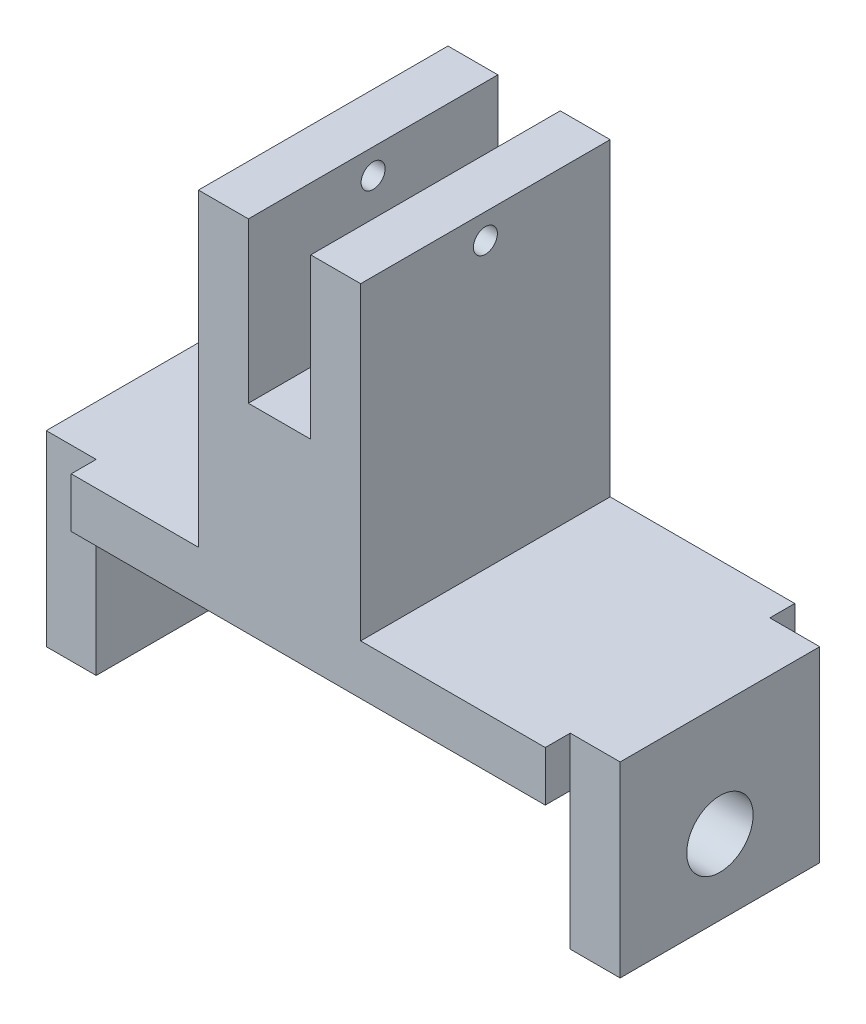
ISO-10303-21;
HEADER;
FILE_DESCRIPTION(('STEP AP214'),'2;1');
FILE_NAME('part.step','',(''),(''),'','','');
FILE_SCHEMA(('AUTOMOTIVE_DESIGN { 1 0 10303 214 1 1 1 1 }'));
ENDSEC;
DATA;
#1=APPLICATION_CONTEXT('core data for automotive mechanical design processes');
#2=APPLICATION_PROTOCOL_DEFINITION('international standard','automotive_design',2000,#1);
#3=PRODUCT_CONTEXT('',#1,'mechanical');
#4=PRODUCT('Part','Part','',(#3));
#5=PRODUCT_RELATED_PRODUCT_CATEGORY('part','',(#4));
#6=PRODUCT_DEFINITION_FORMATION('','',#4);
#7=PRODUCT_DEFINITION_CONTEXT('part definition',#1,'design');
#8=PRODUCT_DEFINITION('design','',#6,#7);
#9=PRODUCT_DEFINITION_SHAPE('','',#8);
#10=(LENGTH_UNIT() NAMED_UNIT(*) SI_UNIT(.MILLI.,.METRE.));
#11=(NAMED_UNIT(*) PLANE_ANGLE_UNIT() SI_UNIT($,.RADIAN.));
#12=(NAMED_UNIT(*) SI_UNIT($,.STERADIAN.) SOLID_ANGLE_UNIT());
#13=UNCERTAINTY_MEASURE_WITH_UNIT(LENGTH_MEASURE(1.E-05),#10,'distance_accuracy_value','');
#14=(GEOMETRIC_REPRESENTATION_CONTEXT(3) GLOBAL_UNCERTAINTY_ASSIGNED_CONTEXT((#13)) GLOBAL_UNIT_ASSIGNED_CONTEXT((#10,
#11,#12)) REPRESENTATION_CONTEXT('',''));
#15=CARTESIAN_POINT('',(0.,0.,0.));
#16=DIRECTION('',(0.,0.,1.));
#17=DIRECTION('',(1.,0.,0.));
#18=AXIS2_PLACEMENT_3D('',#15,#16,#17);
#19=CARTESIAN_POINT('',(48.26,5.08,0.));
#20=DIRECTION('',(-1.,0.,0.));
#21=DIRECTION('',(0.,0.,1.));
#22=AXIS2_PLACEMENT_3D('',#19,#20,#21);
#23=PLANE('',#22);
#24=DIRECTION('',(0.,1.,0.));
#25=VECTOR('',#24,1.);
#26=CARTESIAN_POINT('',(48.26,5.08,-22.86));
#27=LINE('',#26,#25);
#28=CARTESIAN_POINT('',(48.26,0.,-22.86));
#29=VERTEX_POINT('',#28);
#30=CARTESIAN_POINT('',(48.26,5.08,-22.86));
#31=VERTEX_POINT('',#30);
#32=EDGE_CURVE('E11',#29,#31,#27,.T.);
#33=ORIENTED_EDGE('',*,*,#32,.F.);
#34=DIRECTION('',(0.,0.,-1.));
#35=VECTOR('',#34,1.);
#36=CARTESIAN_POINT('',(48.26,0.,0.));
#37=LINE('',#36,#35);
#38=CARTESIAN_POINT('',(48.26,0.,-25.4));
#39=VERTEX_POINT('',#38);
#40=EDGE_CURVE('E328',#29,#39,#37,.T.);
#41=ORIENTED_EDGE('',*,*,#40,.T.);
#42=DIRECTION('',(0.,-1.,0.));
#43=VECTOR('',#42,1.);
#44=CARTESIAN_POINT('',(48.26,5.08,-25.4));
#45=LINE('',#44,#43);
#46=CARTESIAN_POINT('',(48.26,5.08,-25.4));
#47=VERTEX_POINT('',#46);
#48=EDGE_CURVE('E336',#47,#39,#45,.T.);
#49=ORIENTED_EDGE('',*,*,#48,.F.);
#50=DIRECTION('',(0.,0.,-1.));
#51=VECTOR('',#50,1.);
#52=CARTESIAN_POINT('',(48.26,5.08,0.));
#53=LINE('',#52,#51);
#54=EDGE_CURVE('E51',#31,#47,#53,.T.);
#55=ORIENTED_EDGE('',*,*,#54,.F.);
#56=EDGE_LOOP('',(#33,#41,#49,#55));
#57=FACE_BOUND('',#56,.T.);
#58=ADVANCED_FACE('F33',(#57),#23,.F.);
#59=DIRECTION('',(0.,-1.,0.));
#60=VECTOR('',#59,1.);
#61=CARTESIAN_POINT('',(48.26,5.08,-2.54));
#62=LINE('',#61,#60);
#63=CARTESIAN_POINT('',(48.26,5.08,-2.54));
#64=VERTEX_POINT('',#63);
#65=CARTESIAN_POINT('',(48.26,0.,-2.54));
#66=VERTEX_POINT('',#65);
#67=EDGE_CURVE('E58',#64,#66,#62,.T.);
#68=ORIENTED_EDGE('',*,*,#67,.F.);
#69=CARTESIAN_POINT('',(48.26,5.08,0.));
#70=VERTEX_POINT('',#69);
#71=EDGE_CURVE('E207',#70,#64,#53,.T.);
#72=ORIENTED_EDGE('',*,*,#71,.F.);
#73=DIRECTION('',(0.,-1.,0.));
#74=VECTOR('',#73,1.);
#75=CARTESIAN_POINT('',(48.26,5.08,0.));
#76=LINE('',#75,#74);
#77=CARTESIAN_POINT('',(48.26,0.,0.));
#78=VERTEX_POINT('',#77);
#79=EDGE_CURVE('E339',#70,#78,#76,.T.);
#80=ORIENTED_EDGE('',*,*,#79,.T.);
#81=EDGE_CURVE('E329',#78,#66,#37,.T.);
#82=ORIENTED_EDGE('',*,*,#81,.T.);
#83=EDGE_LOOP('',(#68,#72,#80,#82));
#84=FACE_BOUND('',#83,.T.);
#85=ADVANCED_FACE('F435',(#84),#23,.F.);
#86=CARTESIAN_POINT('',(0.,5.08,0.));
#87=DIRECTION('',(1.,0.,0.));
#88=DIRECTION('',(0.,0.,-1.));
#89=AXIS2_PLACEMENT_3D('',#86,#87,#88);
#90=PLANE('',#89);
#91=DIRECTION('',(0.,1.,0.));
#92=VECTOR('',#91,1.);
#93=CARTESIAN_POINT('',(0.,5.08,-2.54));
#94=LINE('',#93,#92);
#95=CARTESIAN_POINT('',(0.,0.,-2.54));
#96=VERTEX_POINT('',#95);
#97=CARTESIAN_POINT('',(0.,5.08,-2.54));
#98=VERTEX_POINT('',#97);
#99=EDGE_CURVE('E42',#96,#98,#94,.T.);
#100=ORIENTED_EDGE('',*,*,#99,.F.);
#101=DIRECTION('',(0.,0.,1.));
#102=VECTOR('',#101,1.);
#103=CARTESIAN_POINT('',(0.,0.,0.));
#104=LINE('',#103,#102);
#105=CARTESIAN_POINT('',(0.,0.,0.));
#106=VERTEX_POINT('',#105);
#107=EDGE_CURVE('E308',#96,#106,#104,.T.);
#108=ORIENTED_EDGE('',*,*,#107,.T.);
#109=DIRECTION('',(0.,-1.,0.));
#110=VECTOR('',#109,1.);
#111=CARTESIAN_POINT('',(0.,5.08,0.));
#112=LINE('',#111,#110);
#113=CARTESIAN_POINT('',(0.,5.08,0.));
#114=VERTEX_POINT('',#113);
#115=EDGE_CURVE('E342',#114,#106,#112,.T.);
#116=ORIENTED_EDGE('',*,*,#115,.F.);
#117=DIRECTION('',(0.,0.,1.));
#118=VECTOR('',#117,1.);
#119=CARTESIAN_POINT('',(0.,5.08,0.));
#120=LINE('',#119,#118);
#121=EDGE_CURVE('E313',#98,#114,#120,.T.);
#122=ORIENTED_EDGE('',*,*,#121,.F.);
#123=EDGE_LOOP('',(#100,#108,#116,#122));
#124=FACE_BOUND('',#123,.T.);
#125=ADVANCED_FACE('F35',(#124),#90,.F.);
#126=DIRECTION('',(0.,-1.,0.));
#127=VECTOR('',#126,1.);
#128=CARTESIAN_POINT('',(0.,5.08,-22.86));
#129=LINE('',#128,#127);
#130=CARTESIAN_POINT('',(0.,5.08,-22.86));
#131=VERTEX_POINT('',#130);
#132=CARTESIAN_POINT('',(0.,0.,-22.86));
#133=VERTEX_POINT('',#132);
#134=EDGE_CURVE('E210',#131,#133,#129,.T.);
#135=ORIENTED_EDGE('',*,*,#134,.F.);
#136=CARTESIAN_POINT('',(0.,5.08,-25.4));
#137=VERTEX_POINT('',#136);
#138=EDGE_CURVE('E309',#137,#131,#120,.T.);
#139=ORIENTED_EDGE('',*,*,#138,.F.);
#140=DIRECTION('',(0.,-1.,0.));
#141=VECTOR('',#140,1.);
#142=CARTESIAN_POINT('',(0.,5.08,-25.4));
#143=LINE('',#142,#141);
#144=CARTESIAN_POINT('',(0.,0.,-25.4));
#145=VERTEX_POINT('',#144);
#146=EDGE_CURVE('E322',#137,#145,#143,.T.);
#147=ORIENTED_EDGE('',*,*,#146,.T.);
#148=EDGE_CURVE('E323',#145,#133,#104,.T.);
#149=ORIENTED_EDGE('',*,*,#148,.T.);
#150=EDGE_LOOP('',(#135,#139,#147,#149));
#151=FACE_BOUND('',#150,.T.);
#152=ADVANCED_FACE('F395',(#151),#90,.F.);
#153=CARTESIAN_POINT('',(0.,5.08,0.));
#154=DIRECTION('',(0.,-1.,0.));
#155=DIRECTION('',(0.,0.,-1.));
#156=AXIS2_PLACEMENT_3D('',#153,#154,#155);
#157=PLANE('',#156);
#158=DIRECTION('',(0.,0.,1.));
#159=VECTOR('',#158,1.);
#160=CARTESIAN_POINT('',(12.954,5.08,-25.4));
#161=LINE('',#160,#159);
#162=CARTESIAN_POINT('',(12.954,5.08,-25.4));
#163=VERTEX_POINT('',#162);
#164=CARTESIAN_POINT('',(12.954,5.08,0.));
#165=VERTEX_POINT('',#164);
#166=EDGE_CURVE('E264',#163,#165,#161,.T.);
#167=ORIENTED_EDGE('',*,*,#166,.F.);
#168=DIRECTION('',(-1.,0.,0.));
#169=VECTOR('',#168,1.);
#170=CARTESIAN_POINT('',(0.,5.08,-25.4));
#171=LINE('',#170,#169);
#172=EDGE_CURVE('E318',#163,#137,#171,.T.);
#173=ORIENTED_EDGE('',*,*,#172,.T.);
#174=ORIENTED_EDGE('',*,*,#138,.T.);
#175=DIRECTION('',(1.,0.,0.));
#176=VECTOR('',#175,1.);
#177=CARTESIAN_POINT('',(-5.08,5.08,-22.86));
#178=LINE('',#177,#176);
#179=CARTESIAN_POINT('',(-5.08,5.08,-22.86));
#180=VERTEX_POINT('',#179);
#181=EDGE_CURVE('E240',#180,#131,#178,.T.);
#182=ORIENTED_EDGE('',*,*,#181,.F.);
#183=DIRECTION('',(0.,0.,-1.));
#184=VECTOR('',#183,1.);
#185=CARTESIAN_POINT('',(-5.08,5.08,-22.86));
#186=LINE('',#185,#184);
#187=CARTESIAN_POINT('',(-5.08,5.08,-2.54));
#188=VERTEX_POINT('',#187);
#189=EDGE_CURVE('E216',#188,#180,#186,.T.);
#190=ORIENTED_EDGE('',*,*,#189,.F.);
#191=DIRECTION('',(1.,0.,0.));
#192=VECTOR('',#191,1.);
#193=CARTESIAN_POINT('',(-5.08,5.08,-2.54));
#194=LINE('',#193,#192);
#195=EDGE_CURVE('E225',#188,#98,#194,.T.);
#196=ORIENTED_EDGE('',*,*,#195,.T.);
#197=ORIENTED_EDGE('',*,*,#121,.T.);
#198=DIRECTION('',(1.,0.,0.));
#199=VECTOR('',#198,1.);
#200=CARTESIAN_POINT('',(0.,5.08,0.));
#201=LINE('',#200,#199);
#202=EDGE_CURVE('E314',#114,#165,#201,.T.);
#203=ORIENTED_EDGE('',*,*,#202,.T.);
#204=EDGE_LOOP('',(#167,#173,#174,#182,#190,#196,#197,#203));
#205=FACE_BOUND('',#204,.T.);
#206=ADVANCED_FACE('F401',(#205),#157,.F.);
#207=DIRECTION('',(0.,0.,-1.));
#208=VECTOR('',#207,1.);
#209=CARTESIAN_POINT('',(29.464,5.08,0.));
#210=LINE('',#209,#208);
#211=CARTESIAN_POINT('',(29.464,5.08,0.));
#212=VERTEX_POINT('',#211);
#213=CARTESIAN_POINT('',(29.464,5.08,-25.4));
#214=VERTEX_POINT('',#213);
#215=EDGE_CURVE('E286',#212,#214,#210,.T.);
#216=ORIENTED_EDGE('',*,*,#215,.F.);
#217=EDGE_CURVE('E312',#212,#70,#201,.T.);
#218=ORIENTED_EDGE('',*,*,#217,.T.);
#219=ORIENTED_EDGE('',*,*,#71,.T.);
#220=DIRECTION('',(-1.,0.,0.));
#221=VECTOR('',#220,1.);
#222=CARTESIAN_POINT('',(53.34,5.08,-2.54));
#223=LINE('',#222,#221);
#224=CARTESIAN_POINT('',(53.34,5.08,-2.54));
#225=VERTEX_POINT('',#224);
#226=EDGE_CURVE('E189',#225,#64,#223,.T.);
#227=ORIENTED_EDGE('',*,*,#226,.F.);
#228=DIRECTION('',(0.,0.,1.));
#229=VECTOR('',#228,1.);
#230=CARTESIAN_POINT('',(53.34,5.08,-2.54));
#231=LINE('',#230,#229);
#232=CARTESIAN_POINT('',(53.34,5.08,-22.86));
#233=VERTEX_POINT('',#232);
#234=EDGE_CURVE('E195',#233,#225,#231,.T.);
#235=ORIENTED_EDGE('',*,*,#234,.F.);
#236=DIRECTION('',(-1.,0.,0.));
#237=VECTOR('',#236,1.);
#238=CARTESIAN_POINT('',(53.34,5.08,-22.86));
#239=LINE('',#238,#237);
#240=EDGE_CURVE('E362',#233,#31,#239,.T.);
#241=ORIENTED_EDGE('',*,*,#240,.T.);
#242=ORIENTED_EDGE('',*,*,#54,.T.);
#243=EDGE_CURVE('E319',#47,#214,#171,.T.);
#244=ORIENTED_EDGE('',*,*,#243,.T.);
#245=EDGE_LOOP('',(#216,#218,#219,#227,#235,#241,#242,#244));
#246=FACE_BOUND('',#245,.T.);
#247=ADVANCED_FACE('F206',(#246),#157,.F.);
#248=CARTESIAN_POINT('',(0.,5.08,0.));
#249=DIRECTION('',(0.,0.,-1.));
#250=DIRECTION('',(-1.,0.,0.));
#251=AXIS2_PLACEMENT_3D('',#248,#249,#250);
#252=PLANE('',#251);
#253=ORIENTED_EDGE('',*,*,#217,.F.);
#254=DIRECTION('',(0.,-1.,0.));
#255=VECTOR('',#254,1.);
#256=CARTESIAN_POINT('',(29.464,36.576,0.));
#257=LINE('',#256,#255);
#258=CARTESIAN_POINT('',(29.464,36.576,0.));
#259=VERTEX_POINT('',#258);
#260=EDGE_CURVE('E303',#259,#212,#257,.T.);
#261=ORIENTED_EDGE('',*,*,#260,.F.);
#262=DIRECTION('',(1.,0.,0.));
#263=VECTOR('',#262,1.);
#264=CARTESIAN_POINT('',(29.464,36.576,0.));
#265=LINE('',#264,#263);
#266=CARTESIAN_POINT('',(24.384,36.576,0.));
#267=VERTEX_POINT('',#266);
#268=EDGE_CURVE('E290',#267,#259,#265,.T.);
#269=ORIENTED_EDGE('',*,*,#268,.F.);
#270=DIRECTION('',(0.,-1.,0.));
#271=VECTOR('',#270,1.);
#272=CARTESIAN_POINT('',(24.384,36.576,0.));
#273=LINE('',#272,#271);
#274=CARTESIAN_POINT('',(24.384,20.32,0.));
#275=VERTEX_POINT('',#274);
#276=EDGE_CURVE('E305',#267,#275,#273,.T.);
#277=ORIENTED_EDGE('',*,*,#276,.T.);
#278=DIRECTION('',(1.,0.,0.));
#279=VECTOR('',#278,1.);
#280=CARTESIAN_POINT('',(-16.6672356258141,20.32,0.));
#281=LINE('',#280,#279);
#282=CARTESIAN_POINT('',(18.034,20.32,0.));
#283=VERTEX_POINT('',#282);
#284=EDGE_CURVE('E244',#283,#275,#281,.T.);
#285=ORIENTED_EDGE('',*,*,#284,.F.);
#286=DIRECTION('',(0.,-1.,0.));
#287=VECTOR('',#286,1.);
#288=CARTESIAN_POINT('',(18.034,36.576,0.));
#289=LINE('',#288,#287);
#290=CARTESIAN_POINT('',(18.034,36.576,0.));
#291=VERTEX_POINT('',#290);
#292=EDGE_CURVE('E274',#291,#283,#289,.T.);
#293=ORIENTED_EDGE('',*,*,#292,.F.);
#294=DIRECTION('',(1.,0.,0.));
#295=VECTOR('',#294,1.);
#296=CARTESIAN_POINT('',(18.034,36.576,0.));
#297=LINE('',#296,#295);
#298=CARTESIAN_POINT('',(12.954,36.576,0.));
#299=VERTEX_POINT('',#298);
#300=EDGE_CURVE('E272',#299,#291,#297,.T.);
#301=ORIENTED_EDGE('',*,*,#300,.F.);
#302=DIRECTION('',(0.,-1.,0.));
#303=VECTOR('',#302,1.);
#304=CARTESIAN_POINT('',(12.954,36.576,0.));
#305=LINE('',#304,#303);
#306=EDGE_CURVE('E279',#299,#165,#305,.T.);
#307=ORIENTED_EDGE('',*,*,#306,.T.);
#308=ORIENTED_EDGE('',*,*,#202,.F.);
#309=ORIENTED_EDGE('',*,*,#115,.T.);
#310=DIRECTION('',(1.,0.,0.));
#311=VECTOR('',#310,1.);
#312=CARTESIAN_POINT('',(0.,0.,0.));
#313=LINE('',#312,#311);
#314=EDGE_CURVE('E325',#106,#78,#313,.T.);
#315=ORIENTED_EDGE('',*,*,#314,.T.);
#316=ORIENTED_EDGE('',*,*,#79,.F.);
#317=EDGE_LOOP('',(#253,#261,#269,#277,#285,#293,#301,#307,#308,#309,#315,#316));
#318=FACE_BOUND('',#317,.T.);
#319=ADVANCED_FACE('F420',(#318),#252,.F.);
#320=CARTESIAN_POINT('',(0.,5.08,-25.4));
#321=DIRECTION('',(0.,0.,1.));
#322=DIRECTION('',(1.,0.,0.));
#323=AXIS2_PLACEMENT_3D('',#320,#321,#322);
#324=PLANE('',#323);
#325=ORIENTED_EDGE('',*,*,#172,.F.);
#326=DIRECTION('',(0.,-1.,0.));
#327=VECTOR('',#326,1.);
#328=CARTESIAN_POINT('',(12.954,36.576,-25.4));
#329=LINE('',#328,#327);
#330=CARTESIAN_POINT('',(12.954,36.576,-25.4));
#331=VERTEX_POINT('',#330);
#332=EDGE_CURVE('E281',#331,#163,#329,.T.);
#333=ORIENTED_EDGE('',*,*,#332,.F.);
#334=DIRECTION('',(-1.,0.,0.));
#335=VECTOR('',#334,1.);
#336=CARTESIAN_POINT('',(18.034,36.576,-25.4));
#337=LINE('',#336,#335);
#338=CARTESIAN_POINT('',(18.034,36.576,-25.4));
#339=VERTEX_POINT('',#338);
#340=EDGE_CURVE('E268',#339,#331,#337,.T.);
#341=ORIENTED_EDGE('',*,*,#340,.F.);
#342=DIRECTION('',(0.,-1.,0.));
#343=VECTOR('',#342,1.);
#344=CARTESIAN_POINT('',(18.034,36.576,-25.4));
#345=LINE('',#344,#343);
#346=CARTESIAN_POINT('',(18.034,20.32,-25.4));
#347=VERTEX_POINT('',#346);
#348=EDGE_CURVE('E283',#339,#347,#345,.T.);
#349=ORIENTED_EDGE('',*,*,#348,.T.);
#350=DIRECTION('',(1.,0.,0.));
#351=VECTOR('',#350,1.);
#352=CARTESIAN_POINT('',(-16.6672356258141,20.32,-25.4));
#353=LINE('',#352,#351);
#354=CARTESIAN_POINT('',(24.384,20.32,-25.4));
#355=VERTEX_POINT('',#354);
#356=EDGE_CURVE('E243',#347,#355,#353,.T.);
#357=ORIENTED_EDGE('',*,*,#356,.T.);
#358=DIRECTION('',(0.,-1.,0.));
#359=VECTOR('',#358,1.);
#360=CARTESIAN_POINT('',(24.384,36.576,-25.4));
#361=LINE('',#360,#359);
#362=CARTESIAN_POINT('',(24.384,36.576,-25.4));
#363=VERTEX_POINT('',#362);
#364=EDGE_CURVE('E296',#363,#355,#361,.T.);
#365=ORIENTED_EDGE('',*,*,#364,.F.);
#366=DIRECTION('',(-1.,0.,0.));
#367=VECTOR('',#366,1.);
#368=CARTESIAN_POINT('',(29.464,36.576,-25.4));
#369=LINE('',#368,#367);
#370=CARTESIAN_POINT('',(29.464,36.576,-25.4));
#371=VERTEX_POINT('',#370);
#372=EDGE_CURVE('E294',#371,#363,#369,.T.);
#373=ORIENTED_EDGE('',*,*,#372,.F.);
#374=DIRECTION('',(0.,-1.,0.));
#375=VECTOR('',#374,1.);
#376=CARTESIAN_POINT('',(29.464,36.576,-25.4));
#377=LINE('',#376,#375);
#378=EDGE_CURVE('E301',#371,#214,#377,.T.);
#379=ORIENTED_EDGE('',*,*,#378,.T.);
#380=ORIENTED_EDGE('',*,*,#243,.F.);
#381=ORIENTED_EDGE('',*,*,#48,.T.);
#382=DIRECTION('',(-1.,0.,0.));
#383=VECTOR('',#382,1.);
#384=CARTESIAN_POINT('',(0.,0.,-25.4));
#385=LINE('',#384,#383);
#386=EDGE_CURVE('E331',#39,#145,#385,.T.);
#387=ORIENTED_EDGE('',*,*,#386,.T.);
#388=ORIENTED_EDGE('',*,*,#146,.F.);
#389=EDGE_LOOP('',(#325,#333,#341,#349,#357,#365,#373,#379,#380,#381,#387,#388));
#390=FACE_BOUND('',#389,.T.);
#391=ADVANCED_FACE('F386',(#390),#324,.F.);
#392=CARTESIAN_POINT('',(0.,0.,0.));
#393=DIRECTION('',(0.,-1.,0.));
#394=DIRECTION('',(0.,0.,-1.));
#395=AXIS2_PLACEMENT_3D('',#392,#393,#394);
#396=PLANE('',#395);
#397=ORIENTED_EDGE('',*,*,#148,.F.);
#398=ORIENTED_EDGE('',*,*,#386,.F.);
#399=ORIENTED_EDGE('',*,*,#40,.F.);
#400=EDGE_CURVE('E332',#66,#29,#37,.T.);
#401=ORIENTED_EDGE('',*,*,#400,.F.);
#402=ORIENTED_EDGE('',*,*,#81,.F.);
#403=ORIENTED_EDGE('',*,*,#314,.F.);
#404=ORIENTED_EDGE('',*,*,#107,.F.);
#405=EDGE_CURVE('E326',#133,#96,#104,.T.);
#406=ORIENTED_EDGE('',*,*,#405,.F.);
#407=EDGE_LOOP('',(#397,#398,#399,#401,#402,#403,#404,#406));
#408=FACE_BOUND('',#407,.T.);
#409=ADVANCED_FACE('F389',(#408),#396,.T.);
#410=CARTESIAN_POINT('',(24.384,36.576,-25.4));
#411=DIRECTION('',(1.,0.,0.));
#412=DIRECTION('',(0.,0.,-1.));
#413=AXIS2_PLACEMENT_3D('',#410,#411,#412);
#414=PLANE('',#413);
#415=CARTESIAN_POINT('',(24.384,34.036,-12.7));
#416=DIRECTION('',(1.,0.,0.));
#417=DIRECTION('',(0.,0.,-1.));
#418=AXIS2_PLACEMENT_3D('',#415,#416,#417);
#419=CIRCLE('',#418,1.2192);
#420=CARTESIAN_POINT('',(24.384,34.036,-13.9192));
#421=VERTEX_POINT('',#420);
#422=EDGE_CURVE('E261',#421,#421,#419,.T.);
#423=ORIENTED_EDGE('',*,*,#422,.T.);
#424=EDGE_LOOP('',(#423));
#425=FACE_BOUND('',#424,.T.);
#426=ORIENTED_EDGE('',*,*,#364,.T.);
#427=DIRECTION('',(0.,0.,1.));
#428=VECTOR('',#427,1.);
#429=CARTESIAN_POINT('',(24.384,20.32,-25.4));
#430=LINE('',#429,#428);
#431=EDGE_CURVE('E251',#355,#275,#430,.T.);
#432=ORIENTED_EDGE('',*,*,#431,.T.);
#433=ORIENTED_EDGE('',*,*,#276,.F.);
#434=DIRECTION('',(0.,0.,1.));
#435=VECTOR('',#434,1.);
#436=CARTESIAN_POINT('',(24.384,36.576,-25.4));
#437=LINE('',#436,#435);
#438=EDGE_CURVE('E287',#363,#267,#437,.T.);
#439=ORIENTED_EDGE('',*,*,#438,.F.);
#440=EDGE_LOOP('',(#426,#432,#433,#439));
#441=FACE_BOUND('',#440,.T.);
#442=ADVANCED_FACE('F425',(#425,#441),#414,.F.);
#443=CARTESIAN_POINT('',(29.464,36.576,0.));
#444=DIRECTION('',(-1.,0.,0.));
#445=DIRECTION('',(0.,0.,1.));
#446=AXIS2_PLACEMENT_3D('',#443,#444,#445);
#447=PLANE('',#446);
#448=CARTESIAN_POINT('',(29.464,34.036,-12.7));
#449=DIRECTION('',(1.,0.,0.));
#450=DIRECTION('',(0.,0.,-1.));
#451=AXIS2_PLACEMENT_3D('',#448,#449,#450);
#452=CIRCLE('',#451,1.2192);
#453=CARTESIAN_POINT('',(29.464,34.036,-13.9192));
#454=VERTEX_POINT('',#453);
#455=EDGE_CURVE('E254',#454,#454,#452,.T.);
#456=ORIENTED_EDGE('',*,*,#455,.F.);
#457=EDGE_LOOP('',(#456));
#458=FACE_BOUND('',#457,.T.);
#459=ORIENTED_EDGE('',*,*,#260,.T.);
#460=ORIENTED_EDGE('',*,*,#215,.T.);
#461=ORIENTED_EDGE('',*,*,#378,.F.);
#462=DIRECTION('',(0.,0.,-1.));
#463=VECTOR('',#462,1.);
#464=CARTESIAN_POINT('',(29.464,36.576,0.));
#465=LINE('',#464,#463);
#466=EDGE_CURVE('E292',#259,#371,#465,.T.);
#467=ORIENTED_EDGE('',*,*,#466,.F.);
#468=EDGE_LOOP('',(#459,#460,#461,#467));
#469=FACE_BOUND('',#468,.T.);
#470=ADVANCED_FACE('F432',(#458,#469),#447,.F.);
#471=CARTESIAN_POINT('',(0.,36.576,0.));
#472=DIRECTION('',(0.,-1.,0.));
#473=DIRECTION('',(0.,0.,-1.));
#474=AXIS2_PLACEMENT_3D('',#471,#472,#473);
#475=PLANE('',#474);
#476=ORIENTED_EDGE('',*,*,#438,.T.);
#477=ORIENTED_EDGE('',*,*,#268,.T.);
#478=ORIENTED_EDGE('',*,*,#466,.T.);
#479=ORIENTED_EDGE('',*,*,#372,.T.);
#480=EDGE_LOOP('',(#476,#477,#478,#479));
#481=FACE_BOUND('',#480,.T.);
#482=ADVANCED_FACE('F429',(#481),#475,.F.);
#483=CARTESIAN_POINT('',(18.034,36.576,-25.4));
#484=DIRECTION('',(-1.,0.,0.));
#485=DIRECTION('',(0.,0.,1.));
#486=AXIS2_PLACEMENT_3D('',#483,#484,#485);
#487=PLANE('',#486);
#488=CARTESIAN_POINT('',(18.034,34.036,-12.7));
#489=DIRECTION('',(-1.,0.,0.));
#490=DIRECTION('',(0.,0.,1.));
#491=AXIS2_PLACEMENT_3D('',#488,#489,#490);
#492=CIRCLE('',#491,1.2192);
#493=CARTESIAN_POINT('',(18.034,34.036,-11.4808));
#494=VERTEX_POINT('',#493);
#495=EDGE_CURVE('E258',#494,#494,#492,.T.);
#496=ORIENTED_EDGE('',*,*,#495,.T.);
#497=EDGE_LOOP('',(#496));
#498=FACE_BOUND('',#497,.T.);
#499=ORIENTED_EDGE('',*,*,#292,.T.);
#500=DIRECTION('',(0.,0.,-1.));
#501=VECTOR('',#500,1.);
#502=CARTESIAN_POINT('',(18.034,20.32,-25.4));
#503=LINE('',#502,#501);
#504=EDGE_CURVE('E246',#283,#347,#503,.T.);
#505=ORIENTED_EDGE('',*,*,#504,.T.);
#506=ORIENTED_EDGE('',*,*,#348,.F.);
#507=DIRECTION('',(0.,0.,-1.));
#508=VECTOR('',#507,1.);
#509=CARTESIAN_POINT('',(18.034,36.576,-25.4));
#510=LINE('',#509,#508);
#511=EDGE_CURVE('E265',#291,#339,#510,.T.);
#512=ORIENTED_EDGE('',*,*,#511,.F.);
#513=EDGE_LOOP('',(#499,#505,#506,#512));
#514=FACE_BOUND('',#513,.T.);
#515=ADVANCED_FACE('F414',(#498,#514),#487,.F.);
#516=CARTESIAN_POINT('',(12.954,36.576,-25.4));
#517=DIRECTION('',(1.,0.,0.));
#518=DIRECTION('',(0.,0.,-1.));
#519=AXIS2_PLACEMENT_3D('',#516,#517,#518);
#520=PLANE('',#519);
#521=CARTESIAN_POINT('',(12.954,34.036,-12.7));
#522=DIRECTION('',(1.,0.,0.));
#523=DIRECTION('',(0.,0.,-1.));
#524=AXIS2_PLACEMENT_3D('',#521,#522,#523);
#525=CIRCLE('',#524,1.2192);
#526=CARTESIAN_POINT('',(12.954,34.036,-13.9192));
#527=VERTEX_POINT('',#526);
#528=EDGE_CURVE('E257',#527,#527,#525,.T.);
#529=ORIENTED_EDGE('',*,*,#528,.T.);
#530=EDGE_LOOP('',(#529));
#531=FACE_BOUND('',#530,.T.);
#532=ORIENTED_EDGE('',*,*,#332,.T.);
#533=ORIENTED_EDGE('',*,*,#166,.T.);
#534=ORIENTED_EDGE('',*,*,#306,.F.);
#535=DIRECTION('',(0.,0.,1.));
#536=VECTOR('',#535,1.);
#537=CARTESIAN_POINT('',(12.954,36.576,-25.4));
#538=LINE('',#537,#536);
#539=EDGE_CURVE('E270',#331,#299,#538,.T.);
#540=ORIENTED_EDGE('',*,*,#539,.F.);
#541=EDGE_LOOP('',(#532,#533,#534,#540));
#542=FACE_BOUND('',#541,.T.);
#543=ADVANCED_FACE('F405',(#531,#542),#520,.F.);
#544=CARTESIAN_POINT('',(0.,36.576,0.));
#545=DIRECTION('',(0.,-1.,0.));
#546=DIRECTION('',(0.,0.,-1.));
#547=AXIS2_PLACEMENT_3D('',#544,#545,#546);
#548=PLANE('',#547);
#549=ORIENTED_EDGE('',*,*,#511,.T.);
#550=ORIENTED_EDGE('',*,*,#340,.T.);
#551=ORIENTED_EDGE('',*,*,#539,.T.);
#552=ORIENTED_EDGE('',*,*,#300,.T.);
#553=EDGE_LOOP('',(#549,#550,#551,#552));
#554=FACE_BOUND('',#553,.T.);
#555=ADVANCED_FACE('F408',(#554),#548,.F.);
#556=CARTESIAN_POINT('',(0.,34.036,-12.7));
#557=DIRECTION('',(1.,0.,0.));
#558=DIRECTION('',(0.,0.,-1.));
#559=AXIS2_PLACEMENT_3D('',#556,#557,#558);
#560=CYLINDRICAL_SURFACE('',#559,1.2192);
#561=ORIENTED_EDGE('',*,*,#528,.F.);
#562=EDGE_LOOP('',(#561));
#563=FACE_BOUND('',#562,.T.);
#564=ORIENTED_EDGE('',*,*,#495,.F.);
#565=EDGE_LOOP('',(#564));
#566=FACE_BOUND('',#565,.T.);
#567=ADVANCED_FACE('F469',(#563,#566),#560,.F.);
#568=ORIENTED_EDGE('',*,*,#455,.T.);
#569=EDGE_LOOP('',(#568));
#570=FACE_BOUND('',#569,.T.);
#571=ORIENTED_EDGE('',*,*,#422,.F.);
#572=EDGE_LOOP('',(#571));
#573=FACE_BOUND('',#572,.T.);
#574=ADVANCED_FACE('F467',(#570,#573),#560,.F.);
#575=CARTESIAN_POINT('',(-16.6672356258141,20.32,0.));
#576=DIRECTION('',(0.,1.,0.));
#577=DIRECTION('',(0.,0.,1.));
#578=AXIS2_PLACEMENT_3D('',#575,#576,#577);
#579=PLANE('',#578);
#580=ORIENTED_EDGE('',*,*,#431,.F.);
#581=ORIENTED_EDGE('',*,*,#356,.F.);
#582=ORIENTED_EDGE('',*,*,#504,.F.);
#583=ORIENTED_EDGE('',*,*,#284,.T.);
#584=EDGE_LOOP('',(#580,#581,#582,#583));
#585=FACE_BOUND('',#584,.T.);
#586=ADVANCED_FACE('F417',(#585),#579,.T.);
#587=CARTESIAN_POINT('',(-5.08,5.08,-22.86));
#588=DIRECTION('',(0.,0.,1.));
#589=DIRECTION('',(0.,-1.,0.));
#590=AXIS2_PLACEMENT_3D('',#587,#588,#589);
#591=PLANE('',#590);
#592=ORIENTED_EDGE('',*,*,#134,.T.);
#593=CARTESIAN_POINT('',(0.,-13.97,-22.86));
#594=VERTEX_POINT('',#593);
#595=EDGE_CURVE('E208',#133,#594,#129,.T.);
#596=ORIENTED_EDGE('',*,*,#595,.T.);
#597=DIRECTION('',(1.,0.,0.));
#598=VECTOR('',#597,1.);
#599=CARTESIAN_POINT('',(-5.08,-13.97,-22.86));
#600=LINE('',#599,#598);
#601=CARTESIAN_POINT('',(-5.08,-13.97,-22.86));
#602=VERTEX_POINT('',#601);
#603=EDGE_CURVE('E237',#602,#594,#600,.T.);
#604=ORIENTED_EDGE('',*,*,#603,.F.);
#605=DIRECTION('',(0.,-1.,0.));
#606=VECTOR('',#605,1.);
#607=CARTESIAN_POINT('',(-5.08,5.08,-22.86));
#608=LINE('',#607,#606);
#609=EDGE_CURVE('E219',#180,#602,#608,.T.);
#610=ORIENTED_EDGE('',*,*,#609,.F.);
#611=ORIENTED_EDGE('',*,*,#181,.T.);
#612=EDGE_LOOP('',(#592,#596,#604,#610,#611));
#613=FACE_BOUND('',#612,.T.);
#614=ADVANCED_FACE('F476',(#613),#591,.F.);
#615=CARTESIAN_POINT('',(-5.08,-13.97,-22.86));
#616=DIRECTION('',(0.,1.,0.));
#617=DIRECTION('',(0.,0.,1.));
#618=AXIS2_PLACEMENT_3D('',#615,#616,#617);
#619=PLANE('',#618);
#620=DIRECTION('',(0.,0.,1.));
#621=VECTOR('',#620,1.);
#622=CARTESIAN_POINT('',(0.,-13.97,-22.86));
#623=LINE('',#622,#621);
#624=CARTESIAN_POINT('',(0.,-13.97,-2.54));
#625=VERTEX_POINT('',#624);
#626=EDGE_CURVE('E228',#594,#625,#623,.T.);
#627=ORIENTED_EDGE('',*,*,#626,.T.);
#628=DIRECTION('',(1.,0.,0.));
#629=VECTOR('',#628,1.);
#630=CARTESIAN_POINT('',(-5.08,-13.97,-2.54));
#631=LINE('',#630,#629);
#632=CARTESIAN_POINT('',(-5.08,-13.97,-2.54));
#633=VERTEX_POINT('',#632);
#634=EDGE_CURVE('E234',#633,#625,#631,.T.);
#635=ORIENTED_EDGE('',*,*,#634,.F.);
#636=DIRECTION('',(0.,0.,1.));
#637=VECTOR('',#636,1.);
#638=CARTESIAN_POINT('',(-5.08,-13.97,-22.86));
#639=LINE('',#638,#637);
#640=EDGE_CURVE('E222',#602,#633,#639,.T.);
#641=ORIENTED_EDGE('',*,*,#640,.F.);
#642=ORIENTED_EDGE('',*,*,#603,.T.);
#643=EDGE_LOOP('',(#627,#635,#641,#642));
#644=FACE_BOUND('',#643,.T.);
#645=ADVANCED_FACE('F674',(#644),#619,.F.);
#646=CARTESIAN_POINT('',(-5.08,5.08,-2.54));
#647=DIRECTION('',(0.,0.,-1.));
#648=DIRECTION('',(0.,1.,0.));
#649=AXIS2_PLACEMENT_3D('',#646,#647,#648);
#650=PLANE('',#649);
#651=EDGE_CURVE('E220',#625,#96,#94,.T.);
#652=ORIENTED_EDGE('',*,*,#651,.T.);
#653=ORIENTED_EDGE('',*,*,#99,.T.);
#654=ORIENTED_EDGE('',*,*,#195,.F.);
#655=DIRECTION('',(0.,1.,0.));
#656=VECTOR('',#655,1.);
#657=CARTESIAN_POINT('',(-5.08,5.08,-2.54));
#658=LINE('',#657,#656);
#659=EDGE_CURVE('E224',#633,#188,#658,.T.);
#660=ORIENTED_EDGE('',*,*,#659,.F.);
#661=ORIENTED_EDGE('',*,*,#634,.T.);
#662=EDGE_LOOP('',(#652,#653,#654,#660,#661));
#663=FACE_BOUND('',#662,.T.);
#664=ADVANCED_FACE('F648',(#663),#650,.F.);
#665=CARTESIAN_POINT('',(-5.08,0.,0.));
#666=DIRECTION('',(1.,0.,0.));
#667=DIRECTION('',(0.,0.,-1.));
#668=AXIS2_PLACEMENT_3D('',#665,#666,#667);
#669=PLANE('',#668);
#670=CARTESIAN_POINT('',(-5.08,-6.35,-12.7));
#671=DIRECTION('',(-1.,0.,0.));
#672=DIRECTION('',(0.,0.,1.));
#673=AXIS2_PLACEMENT_3D('',#670,#671,#672);
#674=CIRCLE('',#673,3.3782);
#675=CARTESIAN_POINT('',(-5.08,-6.35,-9.3218));
#676=VERTEX_POINT('',#675);
#677=EDGE_CURVE('E358',#676,#676,#674,.T.);
#678=ORIENTED_EDGE('',*,*,#677,.F.);
#679=EDGE_LOOP('',(#678));
#680=FACE_BOUND('',#679,.T.);
#681=ORIENTED_EDGE('',*,*,#189,.T.);
#682=ORIENTED_EDGE('',*,*,#609,.T.);
#683=ORIENTED_EDGE('',*,*,#640,.T.);
#684=ORIENTED_EDGE('',*,*,#659,.T.);
#685=EDGE_LOOP('',(#681,#682,#683,#684));
#686=FACE_BOUND('',#685,.T.);
#687=ADVANCED_FACE('F643',(#680,#686),#669,.F.);
#688=CARTESIAN_POINT('',(0.,0.,0.));
#689=DIRECTION('',(1.,0.,0.));
#690=DIRECTION('',(0.,0.,-1.));
#691=AXIS2_PLACEMENT_3D('',#688,#689,#690);
#692=PLANE('',#691);
#693=CARTESIAN_POINT('',(0.,-6.35,-12.7));
#694=DIRECTION('',(1.,0.,0.));
#695=DIRECTION('',(0.,0.,-1.));
#696=AXIS2_PLACEMENT_3D('',#693,#694,#695);
#697=CIRCLE('',#696,3.3782);
#698=CARTESIAN_POINT('',(0.,-6.35,-16.0782));
#699=VERTEX_POINT('',#698);
#700=EDGE_CURVE('E37',#699,#699,#697,.T.);
#701=ORIENTED_EDGE('',*,*,#700,.F.);
#702=EDGE_LOOP('',(#701));
#703=FACE_BOUND('',#702,.T.);
#704=ORIENTED_EDGE('',*,*,#595,.F.);
#705=ORIENTED_EDGE('',*,*,#405,.T.);
#706=ORIENTED_EDGE('',*,*,#651,.F.);
#707=ORIENTED_EDGE('',*,*,#626,.F.);
#708=EDGE_LOOP('',(#704,#705,#706,#707));
#709=FACE_BOUND('',#708,.T.);
#710=ADVANCED_FACE('F591',(#703,#709),#692,.T.);
#711=CARTESIAN_POINT('',(53.34,5.08,-2.54));
#712=DIRECTION('',(0.,0.,-1.));
#713=DIRECTION('',(0.,1.,0.));
#714=AXIS2_PLACEMENT_3D('',#711,#712,#713);
#715=PLANE('',#714);
#716=ORIENTED_EDGE('',*,*,#67,.T.);
#717=CARTESIAN_POINT('',(48.26,-13.97,-2.54));
#718=VERTEX_POINT('',#717);
#719=EDGE_CURVE('E348',#66,#718,#62,.T.);
#720=ORIENTED_EDGE('',*,*,#719,.T.);
#721=DIRECTION('',(-1.,0.,0.));
#722=VECTOR('',#721,1.);
#723=CARTESIAN_POINT('',(53.34,-13.97,-2.54));
#724=LINE('',#723,#722);
#725=CARTESIAN_POINT('',(53.34,-13.97,-2.54));
#726=VERTEX_POINT('',#725);
#727=EDGE_CURVE('E191',#726,#718,#724,.T.);
#728=ORIENTED_EDGE('',*,*,#727,.F.);
#729=DIRECTION('',(0.,-1.,0.));
#730=VECTOR('',#729,1.);
#731=CARTESIAN_POINT('',(53.34,5.08,-2.54));
#732=LINE('',#731,#730);
#733=EDGE_CURVE('E185',#225,#726,#732,.T.);
#734=ORIENTED_EDGE('',*,*,#733,.F.);
#735=ORIENTED_EDGE('',*,*,#226,.T.);
#736=EDGE_LOOP('',(#716,#720,#728,#734,#735));
#737=FACE_BOUND('',#736,.T.);
#738=ADVANCED_FACE('F187',(#737),#715,.F.);
#739=CARTESIAN_POINT('',(53.34,-13.97,-2.54));
#740=DIRECTION('',(0.,1.,0.));
#741=DIRECTION('',(0.,0.,1.));
#742=AXIS2_PLACEMENT_3D('',#739,#740,#741);
#743=PLANE('',#742);
#744=DIRECTION('',(0.,0.,-1.));
#745=VECTOR('',#744,1.);
#746=CARTESIAN_POINT('',(48.26,-13.97,-2.54));
#747=LINE('',#746,#745);
#748=CARTESIAN_POINT('',(48.26,-13.97,-22.86));
#749=VERTEX_POINT('',#748);
#750=EDGE_CURVE('E364',#718,#749,#747,.T.);
#751=ORIENTED_EDGE('',*,*,#750,.T.);
#752=DIRECTION('',(-1.,0.,0.));
#753=VECTOR('',#752,1.);
#754=CARTESIAN_POINT('',(53.34,-13.97,-22.86));
#755=LINE('',#754,#753);
#756=CARTESIAN_POINT('',(53.34,-13.97,-22.86));
#757=VERTEX_POINT('',#756);
#758=EDGE_CURVE('E212',#757,#749,#755,.T.);
#759=ORIENTED_EDGE('',*,*,#758,.F.);
#760=DIRECTION('',(0.,0.,-1.));
#761=VECTOR('',#760,1.);
#762=CARTESIAN_POINT('',(53.34,-13.97,-2.54));
#763=LINE('',#762,#761);
#764=EDGE_CURVE('E194',#726,#757,#763,.T.);
#765=ORIENTED_EDGE('',*,*,#764,.F.);
#766=ORIENTED_EDGE('',*,*,#727,.T.);
#767=EDGE_LOOP('',(#751,#759,#765,#766));
#768=FACE_BOUND('',#767,.T.);
#769=ADVANCED_FACE('F590',(#768),#743,.F.);
#770=CARTESIAN_POINT('',(53.34,5.08,-22.86));
#771=DIRECTION('',(0.,0.,1.));
#772=DIRECTION('',(0.,-1.,0.));
#773=AXIS2_PLACEMENT_3D('',#770,#771,#772);
#774=PLANE('',#773);
#775=EDGE_CURVE('E44',#749,#29,#27,.T.);
#776=ORIENTED_EDGE('',*,*,#775,.T.);
#777=ORIENTED_EDGE('',*,*,#32,.T.);
#778=ORIENTED_EDGE('',*,*,#240,.F.);
#779=DIRECTION('',(0.,1.,0.));
#780=VECTOR('',#779,1.);
#781=CARTESIAN_POINT('',(53.34,5.08,-22.86));
#782=LINE('',#781,#780);
#783=EDGE_CURVE('E200',#757,#233,#782,.T.);
#784=ORIENTED_EDGE('',*,*,#783,.F.);
#785=ORIENTED_EDGE('',*,*,#758,.T.);
#786=EDGE_LOOP('',(#776,#777,#778,#784,#785));
#787=FACE_BOUND('',#786,.T.);
#788=ADVANCED_FACE('F371',(#787),#774,.F.);
#789=CARTESIAN_POINT('',(53.34,0.,0.));
#790=DIRECTION('',(-1.,0.,0.));
#791=DIRECTION('',(0.,0.,1.));
#792=AXIS2_PLACEMENT_3D('',#789,#790,#791);
#793=PLANE('',#792);
#794=CARTESIAN_POINT('',(53.34,-6.35,-12.7));
#795=DIRECTION('',(1.,0.,0.));
#796=DIRECTION('',(0.,0.,-1.));
#797=AXIS2_PLACEMENT_3D('',#794,#795,#796);
#798=CIRCLE('',#797,3.3782);
#799=CARTESIAN_POINT('',(53.34,-6.35,-16.0782));
#800=VERTEX_POINT('',#799);
#801=EDGE_CURVE('E349',#800,#800,#798,.T.);
#802=ORIENTED_EDGE('',*,*,#801,.F.);
#803=EDGE_LOOP('',(#802));
#804=FACE_BOUND('',#803,.T.);
#805=ORIENTED_EDGE('',*,*,#234,.T.);
#806=ORIENTED_EDGE('',*,*,#733,.T.);
#807=ORIENTED_EDGE('',*,*,#764,.T.);
#808=ORIENTED_EDGE('',*,*,#783,.T.);
#809=EDGE_LOOP('',(#805,#806,#807,#808));
#810=FACE_BOUND('',#809,.T.);
#811=ADVANCED_FACE('F198',(#804,#810),#793,.F.);
#812=CARTESIAN_POINT('',(48.26,0.,0.));
#813=DIRECTION('',(-1.,0.,0.));
#814=DIRECTION('',(0.,0.,1.));
#815=AXIS2_PLACEMENT_3D('',#812,#813,#814);
#816=PLANE('',#815);
#817=CARTESIAN_POINT('',(48.26,-6.35,-12.7));
#818=DIRECTION('',(-1.,0.,0.));
#819=DIRECTION('',(0.,0.,1.));
#820=AXIS2_PLACEMENT_3D('',#817,#818,#819);
#821=CIRCLE('',#820,3.3782);
#822=CARTESIAN_POINT('',(48.26,-6.35,-9.3218));
#823=VERTEX_POINT('',#822);
#824=EDGE_CURVE('E346',#823,#823,#821,.T.);
#825=ORIENTED_EDGE('',*,*,#824,.F.);
#826=EDGE_LOOP('',(#825));
#827=FACE_BOUND('',#826,.T.);
#828=ORIENTED_EDGE('',*,*,#719,.F.);
#829=ORIENTED_EDGE('',*,*,#400,.T.);
#830=ORIENTED_EDGE('',*,*,#775,.F.);
#831=ORIENTED_EDGE('',*,*,#750,.F.);
#832=EDGE_LOOP('',(#828,#829,#830,#831));
#833=FACE_BOUND('',#832,.T.);
#834=ADVANCED_FACE('F377',(#827,#833),#816,.T.);
#835=CARTESIAN_POINT('',(46.99,-6.35,-12.7));
#836=DIRECTION('',(1.,0.,0.));
#837=DIRECTION('',(0.,0.,-1.));
#838=AXIS2_PLACEMENT_3D('',#835,#836,#837);
#839=CYLINDRICAL_SURFACE('',#838,3.3782);
#840=ORIENTED_EDGE('',*,*,#824,.T.);
#841=EDGE_LOOP('',(#840));
#842=FACE_BOUND('',#841,.T.);
#843=ORIENTED_EDGE('',*,*,#801,.T.);
#844=EDGE_LOOP('',(#843));
#845=FACE_BOUND('',#844,.T.);
#846=ADVANCED_FACE('F626',(#842,#845),#839,.F.);
#847=CARTESIAN_POINT('',(1.27,-6.35,-12.7));
#848=DIRECTION('',(-1.,0.,0.));
#849=DIRECTION('',(0.,0.,1.));
#850=AXIS2_PLACEMENT_3D('',#847,#848,#849);
#851=CYLINDRICAL_SURFACE('',#850,3.3782);
#852=ORIENTED_EDGE('',*,*,#700,.T.);
#853=EDGE_LOOP('',(#852));
#854=FACE_BOUND('',#853,.T.);
#855=ORIENTED_EDGE('',*,*,#677,.T.);
#856=EDGE_LOOP('',(#855));
#857=FACE_BOUND('',#856,.T.);
#858=ADVANCED_FACE('F636',(#854,#857),#851,.F.);
#859=CLOSED_SHELL('',(#58,#85,#125,#152,#206,#247,#319,#391,#409,#442,#470,#482,#515,#543,#555,
#567,#574,#586,#614,#645,#664,#687,#710,#738,#769,#788,#811,#834,#846,#858));
#860=MANIFOLD_SOLID_BREP('B2',#859);
#861=ADVANCED_BREP_SHAPE_REPRESENTATION('',(#18,#860),#14);
#862=SHAPE_DEFINITION_REPRESENTATION(#9,#861);
ENDSEC;
END-ISO-10303-21;
